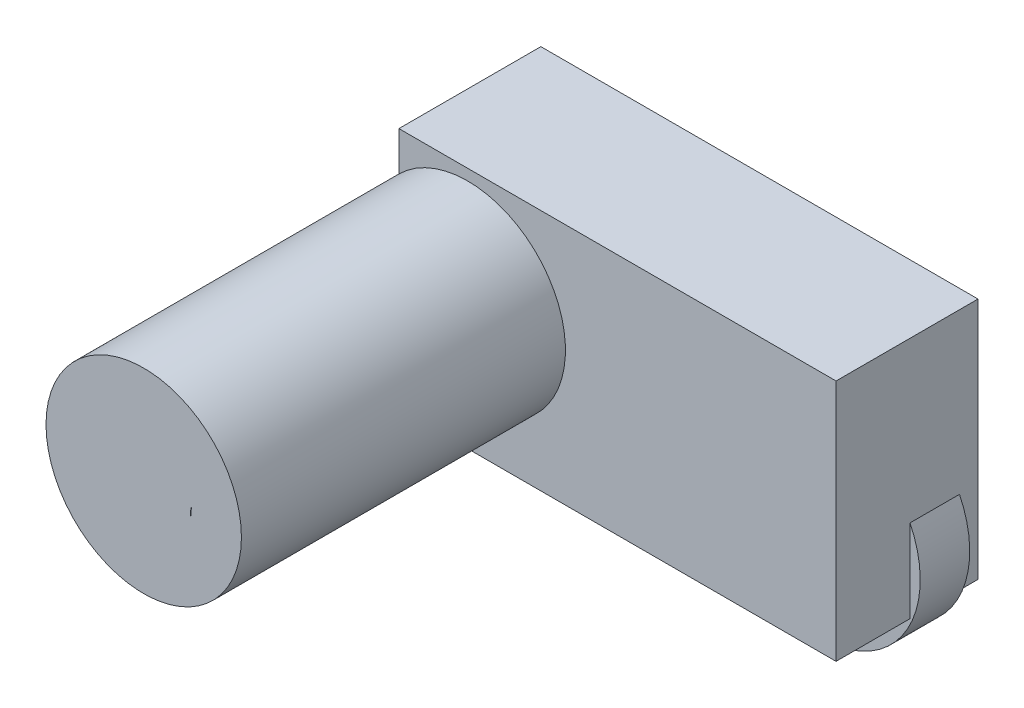
ISO-10303-21;
HEADER;
FILE_DESCRIPTION(('STEP AP214'),'2;1');
FILE_NAME('part.step','',(''),(''),'','','');
FILE_SCHEMA(('AUTOMOTIVE_DESIGN { 1 0 10303 214 1 1 1 1 }'));
ENDSEC;
DATA;
#1=APPLICATION_CONTEXT('core data for automotive mechanical design processes');
#2=APPLICATION_PROTOCOL_DEFINITION('international standard','automotive_design',2000,#1);
#3=PRODUCT_CONTEXT('',#1,'mechanical');
#4=PRODUCT('Part','Part','',(#3));
#5=PRODUCT_RELATED_PRODUCT_CATEGORY('part','',(#4));
#6=PRODUCT_DEFINITION_FORMATION('','',#4);
#7=PRODUCT_DEFINITION_CONTEXT('part definition',#1,'design');
#8=PRODUCT_DEFINITION('design','',#6,#7);
#9=PRODUCT_DEFINITION_SHAPE('','',#8);
#10=(LENGTH_UNIT() NAMED_UNIT(*) SI_UNIT(.MILLI.,.METRE.));
#11=(NAMED_UNIT(*) PLANE_ANGLE_UNIT() SI_UNIT($,.RADIAN.));
#12=(NAMED_UNIT(*) SI_UNIT($,.STERADIAN.) SOLID_ANGLE_UNIT());
#13=UNCERTAINTY_MEASURE_WITH_UNIT(LENGTH_MEASURE(1.E-05),#10,'distance_accuracy_value','');
#14=(GEOMETRIC_REPRESENTATION_CONTEXT(3) GLOBAL_UNCERTAINTY_ASSIGNED_CONTEXT((#13)) GLOBAL_UNIT_ASSIGNED_CONTEXT((#10,
#11,#12)) REPRESENTATION_CONTEXT('',''));
#15=CARTESIAN_POINT('',(0.,0.,0.));
#16=DIRECTION('',(0.,0.,1.));
#17=DIRECTION('',(1.,0.,0.));
#18=AXIS2_PLACEMENT_3D('',#15,#16,#17);
#19=CARTESIAN_POINT('',(62.5414024105058,-7.55077319146769,0.));
#20=DIRECTION('',(0.,0.,-1.));
#21=DIRECTION('',(-1.,0.,0.));
#22=AXIS2_PLACEMENT_3D('',#19,#20,#21);
#23=PLANE('',#22);
#24=CARTESIAN_POINT('',(-9.08017470120266,18.5374457641994,0.));
#25=DIRECTION('',(0.,0.,-1.));
#26=DIRECTION('',(-1.,0.,0.));
#27=AXIS2_PLACEMENT_3D('',#24,#25,#26);
#28=CIRCLE('',#27,19.);
#29=CARTESIAN_POINT('',(-22.4585975894942,32.0288430610711,0.));
#30=VERTEX_POINT('',#29);
#31=CARTESIAN_POINT('',(-22.4585975894942,5.04604846732777,0.));
#32=VERTEX_POINT('',#31);
#33=EDGE_CURVE('E129',#30,#32,#28,.T.);
#34=ORIENTED_EDGE('',*,*,#33,.T.);
#35=DIRECTION('',(0.,1.,0.));
#36=VECTOR('',#35,1.);
#37=CARTESIAN_POINT('',(-22.4585975894942,39.669557012058,0.));
#38=LINE('',#37,#36);
#39=CARTESIAN_POINT('',(-22.4585975894942,-7.55077319146769,0.));
#40=VERTEX_POINT('',#39);
#41=EDGE_CURVE('E159',#40,#32,#38,.T.);
#42=ORIENTED_EDGE('',*,*,#41,.F.);
#43=DIRECTION('',(-1.,0.,0.));
#44=VECTOR('',#43,1.);
#45=CARTESIAN_POINT('',(62.5414024105058,-7.55077319146769,0.));
#46=LINE('',#45,#44);
#47=CARTESIAN_POINT('',(62.5414024105058,-7.55077319146769,0.));
#48=VERTEX_POINT('',#47);
#49=EDGE_CURVE('E164',#48,#40,#46,.T.);
#50=ORIENTED_EDGE('',*,*,#49,.F.);
#51=DIRECTION('',(0.,-1.,0.));
#52=VECTOR('',#51,1.);
#53=CARTESIAN_POINT('',(62.5414024105058,39.669557012058,0.));
#54=LINE('',#53,#52);
#55=CARTESIAN_POINT('',(62.5414024105058,39.669557012058,0.));
#56=VERTEX_POINT('',#55);
#57=EDGE_CURVE('E167',#56,#48,#54,.T.);
#58=ORIENTED_EDGE('',*,*,#57,.F.);
#59=DIRECTION('',(1.,0.,0.));
#60=VECTOR('',#59,1.);
#61=CARTESIAN_POINT('',(62.5414024105058,39.669557012058,0.));
#62=LINE('',#61,#60);
#63=CARTESIAN_POINT('',(-22.4585975894942,39.669557012058,0.));
#64=VERTEX_POINT('',#63);
#65=EDGE_CURVE('E155',#64,#56,#62,.T.);
#66=ORIENTED_EDGE('',*,*,#65,.F.);
#67=EDGE_CURVE('E163',#30,#64,#38,.T.);
#68=ORIENTED_EDGE('',*,*,#67,.F.);
#69=EDGE_LOOP('',(#34,#42,#50,#58,#66,#68));
#70=FACE_BOUND('',#69,.T.);
#71=ADVANCED_FACE('F32',(#70),#23,.F.);
#72=CARTESIAN_POINT('',(62.5414024105058,39.669557012058,-27.6));
#73=DIRECTION('',(-1.,0.,0.));
#74=DIRECTION('',(0.,0.,1.));
#75=AXIS2_PLACEMENT_3D('',#72,#73,#74);
#76=PLANE('',#75);
#77=DIRECTION('',(0.,0.,1.));
#78=VECTOR('',#77,1.);
#79=CARTESIAN_POINT('',(62.5414024105058,8.5791283346381,-24.));
#80=LINE('',#79,#78);
#81=CARTESIAN_POINT('',(62.5414024105058,8.5791283346381,-24.));
#82=VERTEX_POINT('',#81);
#83=CARTESIAN_POINT('',(62.5414024105058,8.5791283346381,-14.38));
#84=VERTEX_POINT('',#83);
#85=EDGE_CURVE('E111',#82,#84,#80,.T.);
#86=ORIENTED_EDGE('',*,*,#85,.F.);
#87=DIRECTION('',(0.,-1.,0.));
#88=VECTOR('',#87,1.);
#89=CARTESIAN_POINT('',(62.5414024105058,39.669557012058,-24.));
#90=LINE('',#89,#88);
#91=CARTESIAN_POINT('',(62.5414024105058,-7.55077319146769,-24.));
#92=VERTEX_POINT('',#91);
#93=EDGE_CURVE('E180',#82,#92,#90,.T.);
#94=ORIENTED_EDGE('',*,*,#93,.T.);
#95=DIRECTION('',(0.,0.,1.));
#96=VECTOR('',#95,1.);
#97=CARTESIAN_POINT('',(62.5414024105058,-7.55077319146769,-27.6));
#98=LINE('',#97,#96);
#99=CARTESIAN_POINT('',(62.5414024105058,-7.55077319146769,-27.6));
#100=VERTEX_POINT('',#99);
#101=EDGE_CURVE('E145',#100,#92,#98,.T.);
#102=ORIENTED_EDGE('',*,*,#101,.F.);
#103=DIRECTION('',(0.,-1.,0.));
#104=VECTOR('',#103,1.);
#105=CARTESIAN_POINT('',(62.5414024105058,39.669557012058,-27.6));
#106=LINE('',#105,#104);
#107=CARTESIAN_POINT('',(62.5414024105058,39.669557012058,-27.6));
#108=VERTEX_POINT('',#107);
#109=EDGE_CURVE('E158',#108,#100,#106,.T.);
#110=ORIENTED_EDGE('',*,*,#109,.F.);
#111=DIRECTION('',(0.,0.,1.));
#112=VECTOR('',#111,1.);
#113=CARTESIAN_POINT('',(62.5414024105058,39.669557012058,-27.6));
#114=LINE('',#113,#112);
#115=EDGE_CURVE('E152',#108,#56,#114,.T.);
#116=ORIENTED_EDGE('',*,*,#115,.T.);
#117=ORIENTED_EDGE('',*,*,#57,.T.);
#118=CARTESIAN_POINT('',(62.5414024105058,-7.55077319146769,-14.38));
#119=VERTEX_POINT('',#118);
#120=EDGE_CURVE('E147',#119,#48,#98,.T.);
#121=ORIENTED_EDGE('',*,*,#120,.F.);
#122=DIRECTION('',(0.,-1.,0.));
#123=VECTOR('',#122,1.);
#124=CARTESIAN_POINT('',(62.5414024105058,39.669557012058,-14.38));
#125=LINE('',#124,#123);
#126=EDGE_CURVE('E115',#84,#119,#125,.T.);
#127=ORIENTED_EDGE('',*,*,#126,.F.);
#128=EDGE_LOOP('',(#86,#94,#102,#110,#116,#117,#121,#127));
#129=FACE_BOUND('',#128,.T.);
#130=ADVANCED_FACE('F188',(#129),#76,.F.);
#131=CARTESIAN_POINT('',(62.5414024105058,-7.55077319146769,-27.6));
#132=DIRECTION('',(0.,1.,0.));
#133=DIRECTION('',(0.,0.,-1.));
#134=AXIS2_PLACEMENT_3D('',#131,#132,#133);
#135=PLANE('',#134);
#136=ORIENTED_EDGE('',*,*,#101,.T.);
#137=DIRECTION('',(-1.,0.,0.));
#138=VECTOR('',#137,1.);
#139=CARTESIAN_POINT('',(62.5414024105058,-7.55077319146769,-24.));
#140=LINE('',#139,#138);
#141=CARTESIAN_POINT('',(27.0512584060541,-7.55077319146769,-24.));
#142=VERTEX_POINT('',#141);
#143=EDGE_CURVE('E11',#92,#142,#140,.T.);
#144=ORIENTED_EDGE('',*,*,#143,.T.);
#145=DIRECTION('',(0.,0.,1.));
#146=VECTOR('',#145,1.);
#147=CARTESIAN_POINT('',(27.0512584060541,-7.55077319146769,-24.));
#148=LINE('',#147,#146);
#149=CARTESIAN_POINT('',(27.0512584060541,-7.55077319146769,-14.38));
#150=VERTEX_POINT('',#149);
#151=EDGE_CURVE('E40',#150,#142,#148,.F.);
#152=ORIENTED_EDGE('',*,*,#151,.F.);
#153=DIRECTION('',(-1.,0.,0.));
#154=VECTOR('',#153,1.);
#155=CARTESIAN_POINT('',(62.5414024105058,-7.55077319146769,-14.38));
#156=LINE('',#155,#154);
#157=EDGE_CURVE('E113',#119,#150,#156,.T.);
#158=ORIENTED_EDGE('',*,*,#157,.F.);
#159=ORIENTED_EDGE('',*,*,#120,.T.);
#160=ORIENTED_EDGE('',*,*,#49,.T.);
#161=DIRECTION('',(0.,0.,1.));
#162=VECTOR('',#161,1.);
#163=CARTESIAN_POINT('',(-22.4585975894942,-7.55077319146769,-27.6));
#164=LINE('',#163,#162);
#165=CARTESIAN_POINT('',(-22.4585975894942,-7.55077319146769,-27.6));
#166=VERTEX_POINT('',#165);
#167=EDGE_CURVE('E148',#166,#40,#164,.T.);
#168=ORIENTED_EDGE('',*,*,#167,.F.);
#169=DIRECTION('',(-1.,0.,0.));
#170=VECTOR('',#169,1.);
#171=CARTESIAN_POINT('',(62.5414024105058,-7.55077319146769,-27.6));
#172=LINE('',#171,#170);
#173=EDGE_CURVE('E174',#100,#166,#172,.T.);
#174=ORIENTED_EDGE('',*,*,#173,.F.);
#175=EDGE_LOOP('',(#136,#144,#152,#158,#159,#160,#168,#174));
#176=FACE_BOUND('',#175,.T.);
#177=ADVANCED_FACE('F121',(#176),#135,.F.);
#178=CARTESIAN_POINT('',(-22.4585975894942,39.669557012058,-27.6));
#179=DIRECTION('',(1.,0.,0.));
#180=DIRECTION('',(0.,-1.,0.));
#181=AXIS2_PLACEMENT_3D('',#178,#179,#180);
#182=PLANE('',#181);
#183=ORIENTED_EDGE('',*,*,#41,.T.);
#184=EDGE_CURVE('E162',#32,#30,#38,.T.);
#185=ORIENTED_EDGE('',*,*,#184,.T.);
#186=ORIENTED_EDGE('',*,*,#67,.T.);
#187=DIRECTION('',(0.,0.,1.));
#188=VECTOR('',#187,1.);
#189=CARTESIAN_POINT('',(-22.4585975894942,39.669557012058,-27.6));
#190=LINE('',#189,#188);
#191=CARTESIAN_POINT('',(-22.4585975894942,39.669557012058,-27.6));
#192=VERTEX_POINT('',#191);
#193=EDGE_CURVE('E150',#192,#64,#190,.T.);
#194=ORIENTED_EDGE('',*,*,#193,.F.);
#195=DIRECTION('',(0.,1.,0.));
#196=VECTOR('',#195,1.);
#197=CARTESIAN_POINT('',(-22.4585975894942,39.669557012058,-27.6));
#198=LINE('',#197,#196);
#199=EDGE_CURVE('E171',#166,#192,#198,.T.);
#200=ORIENTED_EDGE('',*,*,#199,.F.);
#201=ORIENTED_EDGE('',*,*,#167,.T.);
#202=EDGE_LOOP('',(#183,#185,#186,#194,#200,#201));
#203=FACE_BOUND('',#202,.T.);
#204=ADVANCED_FACE('F198',(#203),#182,.F.);
#205=CARTESIAN_POINT('',(62.5414024105058,39.669557012058,-27.6));
#206=DIRECTION('',(0.,-1.,0.));
#207=DIRECTION('',(0.,0.,1.));
#208=AXIS2_PLACEMENT_3D('',#205,#206,#207);
#209=PLANE('',#208);
#210=ORIENTED_EDGE('',*,*,#65,.T.);
#211=ORIENTED_EDGE('',*,*,#115,.F.);
#212=DIRECTION('',(1.,0.,0.));
#213=VECTOR('',#212,1.);
#214=CARTESIAN_POINT('',(62.5414024105058,39.669557012058,-27.6));
#215=LINE('',#214,#213);
#216=EDGE_CURVE('E154',#192,#108,#215,.T.);
#217=ORIENTED_EDGE('',*,*,#216,.F.);
#218=ORIENTED_EDGE('',*,*,#193,.T.);
#219=EDGE_LOOP('',(#210,#211,#217,#218));
#220=FACE_BOUND('',#219,.T.);
#221=ADVANCED_FACE('F208',(#220),#209,.F.);
#222=CARTESIAN_POINT('',(62.5414024105058,-7.55077319146769,-27.6));
#223=DIRECTION('',(0.,0.,-1.));
#224=DIRECTION('',(-1.,0.,0.));
#225=AXIS2_PLACEMENT_3D('',#222,#223,#224);
#226=PLANE('',#225);
#227=ORIENTED_EDGE('',*,*,#109,.T.);
#228=ORIENTED_EDGE('',*,*,#173,.T.);
#229=ORIENTED_EDGE('',*,*,#199,.T.);
#230=ORIENTED_EDGE('',*,*,#216,.T.);
#231=EDGE_LOOP('',(#227,#228,#229,#230));
#232=FACE_BOUND('',#231,.T.);
#233=ADVANCED_FACE('F203',(#232),#226,.T.);
#234=CARTESIAN_POINT('',(21.1862419644348,17.1813946890512,63.));
#235=DIRECTION('',(0.,0.,-1.));
#236=DIRECTION('',(-1.,0.,0.));
#237=AXIS2_PLACEMENT_3D('',#234,#235,#236);
#238=CYLINDRICAL_SURFACE('',#237,21.15);
#239=CARTESIAN_POINT('',(21.1862419644348,17.1813946890512,0.));
#240=DIRECTION('',(0.,0.,-1.));
#241=DIRECTION('',(-1.,0.,0.));
#242=AXIS2_PLACEMENT_3D('',#239,#240,#241);
#243=CIRCLE('',#242,21.15);
#244=CARTESIAN_POINT('',(0.140259901825004,19.2764219013581,0.));
#245=VERTEX_POINT('',#244);
#246=CARTESIAN_POINT('',(0.0372309394255036,16.9768643391397,0.));
#247=VERTEX_POINT('',#246);
#248=EDGE_CURVE('E136',#245,#247,#243,.F.);
#249=ORIENTED_EDGE('',*,*,#248,.F.);
#250=DIRECTION('',(0.,0.,-1.));
#251=VECTOR('',#250,1.);
#252=CARTESIAN_POINT('',(0.140259901825004,19.2764219013581,63.));
#253=LINE('',#252,#251);
#254=CARTESIAN_POINT('',(0.140259901825004,19.2764219013581,63.));
#255=VERTEX_POINT('',#254);
#256=EDGE_CURVE('E123',#255,#245,#253,.T.);
#257=ORIENTED_EDGE('',*,*,#256,.F.);
#258=CARTESIAN_POINT('',(21.1862419644348,17.1813946890512,63.));
#259=DIRECTION('',(0.,0.,-1.));
#260=DIRECTION('',(-1.,0.,0.));
#261=AXIS2_PLACEMENT_3D('',#258,#259,#260);
#262=CIRCLE('',#261,21.15);
#263=CARTESIAN_POINT('',(0.0372309394255019,16.9768643391397,63.));
#264=VERTEX_POINT('',#263);
#265=EDGE_CURVE('E139',#264,#255,#262,.T.);
#266=ORIENTED_EDGE('',*,*,#265,.F.);
#267=DIRECTION('',(0.,0.,-1.));
#268=VECTOR('',#267,1.);
#269=CARTESIAN_POINT('',(0.0372309394255019,16.9768643391397,63.));
#270=LINE('',#269,#268);
#271=EDGE_CURVE('E118',#264,#247,#270,.T.);
#272=ORIENTED_EDGE('',*,*,#271,.T.);
#273=EDGE_LOOP('',(#249,#257,#266,#272));
#274=FACE_BOUND('',#273,.T.);
#275=ADVANCED_FACE('F214',(#274),#238,.F.);
#276=CARTESIAN_POINT('',(19.9295775037876,-71.9989985881213,0.));
#277=DIRECTION('',(0.,0.,-1.));
#278=DIRECTION('',(-1.,0.,0.));
#279=AXIS2_PLACEMENT_3D('',#276,#277,#278);
#280=PLANE('',#279);
#281=EDGE_CURVE('E133',#32,#30,#28,.T.);
#282=ORIENTED_EDGE('',*,*,#281,.T.);
#283=ORIENTED_EDGE('',*,*,#184,.F.);
#284=EDGE_LOOP('',(#282,#283));
#285=FACE_BOUND('',#284,.T.);
#286=ADVANCED_FACE('F212',(#285),#280,.T.);
#287=CARTESIAN_POINT('',(-9.08017470120266,18.5374457641994,63.));
#288=DIRECTION('',(0.,0.,-1.));
#289=DIRECTION('',(-1.,0.,0.));
#290=AXIS2_PLACEMENT_3D('',#287,#288,#289);
#291=CYLINDRICAL_SURFACE('',#290,9.24999999999999);
#292=CARTESIAN_POINT('',(-9.08017470120266,18.5374457641994,0.));
#293=DIRECTION('',(0.,0.,-1.));
#294=DIRECTION('',(-1.,0.,0.));
#295=AXIS2_PLACEMENT_3D('',#292,#293,#294);
#296=CIRCLE('',#295,9.24999999999999);
#297=EDGE_CURVE('E134',#245,#247,#296,.T.);
#298=ORIENTED_EDGE('',*,*,#297,.T.);
#299=ORIENTED_EDGE('',*,*,#271,.F.);
#300=CARTESIAN_POINT('',(-9.08017470120266,18.5374457641994,63.));
#301=DIRECTION('',(0.,0.,-1.));
#302=DIRECTION('',(-1.,0.,0.));
#303=AXIS2_PLACEMENT_3D('',#300,#301,#302);
#304=CIRCLE('',#303,9.24999999999999);
#305=EDGE_CURVE('E132',#255,#264,#304,.T.);
#306=ORIENTED_EDGE('',*,*,#305,.F.);
#307=ORIENTED_EDGE('',*,*,#256,.T.);
#308=EDGE_LOOP('',(#298,#299,#306,#307));
#309=FACE_BOUND('',#308,.T.);
#310=ADVANCED_FACE('F34',(#309),#291,.F.);
#311=CARTESIAN_POINT('',(-9.08017470120266,18.5374457641994,63.));
#312=DIRECTION('',(0.,0.,-1.));
#313=DIRECTION('',(-1.,0.,0.));
#314=AXIS2_PLACEMENT_3D('',#311,#312,#313);
#315=CYLINDRICAL_SURFACE('',#314,19.);
#316=CARTESIAN_POINT('',(-9.08017470120266,18.5374457641994,63.));
#317=DIRECTION('',(0.,0.,-1.));
#318=DIRECTION('',(-1.,0.,0.));
#319=AXIS2_PLACEMENT_3D('',#316,#317,#318);
#320=CIRCLE('',#319,19.);
#321=CARTESIAN_POINT('',(-28.0801747012027,18.5374457641994,63.));
#322=VERTEX_POINT('',#321);
#323=EDGE_CURVE('E126',#322,#322,#320,.T.);
#324=ORIENTED_EDGE('',*,*,#323,.T.);
#325=EDGE_LOOP('',(#324));
#326=FACE_BOUND('',#325,.T.);
#327=ORIENTED_EDGE('',*,*,#33,.F.);
#328=ORIENTED_EDGE('',*,*,#281,.F.);
#329=EDGE_LOOP('',(#327,#328));
#330=FACE_BOUND('',#329,.T.);
#331=ADVANCED_FACE('F210',(#326,#330),#315,.T.);
#332=CARTESIAN_POINT('',(19.9295775037876,-71.9989985881213,63.));
#333=DIRECTION('',(0.,0.,-1.));
#334=DIRECTION('',(-1.,0.,0.));
#335=AXIS2_PLACEMENT_3D('',#332,#333,#334);
#336=PLANE('',#335);
#337=ORIENTED_EDGE('',*,*,#305,.T.);
#338=ORIENTED_EDGE('',*,*,#265,.T.);
#339=EDGE_LOOP('',(#337,#338));
#340=FACE_BOUND('',#339,.T.);
#341=ORIENTED_EDGE('',*,*,#323,.F.);
#342=EDGE_LOOP('',(#341));
#343=FACE_BOUND('',#342,.T.);
#344=ADVANCED_FACE('F234',(#340,#343),#336,.F.);
#345=ORIENTED_EDGE('',*,*,#248,.T.);
#346=ORIENTED_EDGE('',*,*,#297,.F.);
#347=EDGE_LOOP('',(#345,#346));
#348=FACE_BOUND('',#347,.T.);
#349=ADVANCED_FACE('F226',(#348),#23,.F.);
#350=CARTESIAN_POINT('',(45.0300187696335,0.,-24.));
#351=DIRECTION('',(0.,0.,1.));
#352=DIRECTION('',(1.,0.,0.));
#353=AXIS2_PLACEMENT_3D('',#350,#351,#352);
#354=CYLINDRICAL_SURFACE('',#353,19.5);
#355=CARTESIAN_POINT('',(45.0300187696335,0.,-24.));
#356=DIRECTION('',(0.,0.,-1.));
#357=DIRECTION('',(-1.,0.,0.));
#358=AXIS2_PLACEMENT_3D('',#355,#356,#357);
#359=CIRCLE('',#358,19.5);
#360=EDGE_CURVE('E47',#82,#142,#359,.T.);
#361=ORIENTED_EDGE('',*,*,#360,.F.);
#362=ORIENTED_EDGE('',*,*,#85,.T.);
#363=CARTESIAN_POINT('',(45.0300187696335,0.,-14.38));
#364=DIRECTION('',(0.,0.,-1.));
#365=DIRECTION('',(-1.,0.,0.));
#366=AXIS2_PLACEMENT_3D('',#363,#364,#365);
#367=CIRCLE('',#366,19.5);
#368=EDGE_CURVE('E55',#84,#150,#367,.T.);
#369=ORIENTED_EDGE('',*,*,#368,.T.);
#370=ORIENTED_EDGE('',*,*,#151,.T.);
#371=EDGE_LOOP('',(#361,#362,#369,#370));
#372=FACE_BOUND('',#371,.T.);
#373=ADVANCED_FACE('F108',(#372),#354,.T.);
#374=CARTESIAN_POINT('',(32.0387692987252,-58.7947184610287,-24.));
#375=DIRECTION('',(0.,0.,-1.));
#376=DIRECTION('',(-1.,0.,0.));
#377=AXIS2_PLACEMENT_3D('',#374,#375,#376);
#378=PLANE('',#377);
#379=ORIENTED_EDGE('',*,*,#93,.F.);
#380=ORIENTED_EDGE('',*,*,#360,.T.);
#381=ORIENTED_EDGE('',*,*,#143,.F.);
#382=EDGE_LOOP('',(#379,#380,#381));
#383=FACE_BOUND('',#382,.T.);
#384=ADVANCED_FACE('F185',(#383),#378,.T.);
#385=CARTESIAN_POINT('',(32.0387692987252,-58.7947184610287,-14.38));
#386=DIRECTION('',(0.,0.,-1.));
#387=DIRECTION('',(-1.,0.,0.));
#388=AXIS2_PLACEMENT_3D('',#385,#386,#387);
#389=PLANE('',#388);
#390=ORIENTED_EDGE('',*,*,#368,.F.);
#391=ORIENTED_EDGE('',*,*,#126,.T.);
#392=ORIENTED_EDGE('',*,*,#157,.T.);
#393=EDGE_LOOP('',(#390,#391,#392));
#394=FACE_BOUND('',#393,.T.);
#395=ADVANCED_FACE('F114',(#394),#389,.F.);
#396=CLOSED_SHELL('',(#71,#130,#177,#204,#221,#233,#275,#286,#310,#331,#344,#349,#373,#384,#395));
#397=MANIFOLD_SOLID_BREP('B2',#396);
#398=ADVANCED_BREP_SHAPE_REPRESENTATION('',(#18,#397),#14);
#399=SHAPE_DEFINITION_REPRESENTATION(#9,#398);
ENDSEC;
END-ISO-10303-21;
